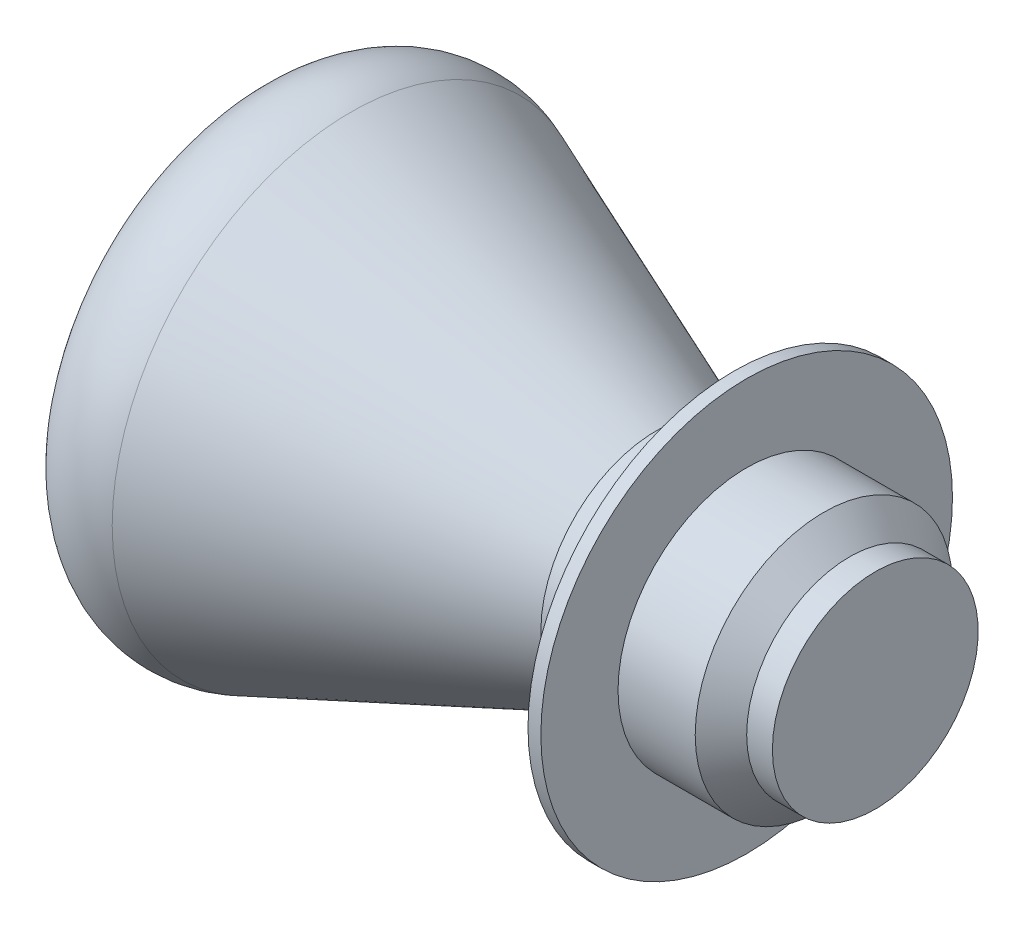
ISO-10303-21;
HEADER;
FILE_DESCRIPTION(('STEP AP214'),'2;1');
FILE_NAME('part.step','',(''),(''),'','','');
FILE_SCHEMA(('AUTOMOTIVE_DESIGN { 1 0 10303 214 1 1 1 1 }'));
ENDSEC;
DATA;
#1=APPLICATION_CONTEXT('core data for automotive mechanical design processes');
#2=APPLICATION_PROTOCOL_DEFINITION('international standard','automotive_design',2000,#1);
#3=PRODUCT_CONTEXT('',#1,'mechanical');
#4=PRODUCT('Part','Part','',(#3));
#5=PRODUCT_RELATED_PRODUCT_CATEGORY('part','',(#4));
#6=PRODUCT_DEFINITION_FORMATION('','',#4);
#7=PRODUCT_DEFINITION_CONTEXT('part definition',#1,'design');
#8=PRODUCT_DEFINITION('design','',#6,#7);
#9=PRODUCT_DEFINITION_SHAPE('','',#8);
#10=(LENGTH_UNIT() NAMED_UNIT(*) SI_UNIT(.MILLI.,.METRE.));
#11=(NAMED_UNIT(*) PLANE_ANGLE_UNIT() SI_UNIT($,.RADIAN.));
#12=(NAMED_UNIT(*) SI_UNIT($,.STERADIAN.) SOLID_ANGLE_UNIT());
#13=UNCERTAINTY_MEASURE_WITH_UNIT(LENGTH_MEASURE(1.E-05),#10,'distance_accuracy_value','');
#14=(GEOMETRIC_REPRESENTATION_CONTEXT(3) GLOBAL_UNCERTAINTY_ASSIGNED_CONTEXT((#13)) GLOBAL_UNIT_ASSIGNED_CONTEXT((#10,
#11,#12)) REPRESENTATION_CONTEXT('',''));
#15=CARTESIAN_POINT('',(0.,0.,0.));
#16=DIRECTION('',(0.,0.,1.));
#17=DIRECTION('',(1.,0.,0.));
#18=AXIS2_PLACEMENT_3D('',#15,#16,#17);
#19=CARTESIAN_POINT('',(5.5,0.,0.));
#20=DIRECTION('',(-1.,0.,0.));
#21=DIRECTION('',(0.,0.,1.));
#22=AXIS2_PLACEMENT_3D('',#19,#20,#21);
#23=PLANE('',#22);
#24=CARTESIAN_POINT('',(5.5,0.,0.));
#25=DIRECTION('',(-1.,0.,0.));
#26=DIRECTION('',(0.,0.,1.));
#27=AXIS2_PLACEMENT_3D('',#24,#25,#26);
#28=CIRCLE('',#27,4.);
#29=CARTESIAN_POINT('',(5.5,0.,4.));
#30=VERTEX_POINT('',#29);
#31=EDGE_CURVE('E10',#30,#30,#28,.T.);
#32=ORIENTED_EDGE('',*,*,#31,.F.);
#33=EDGE_LOOP('',(#32));
#34=FACE_BOUND('',#33,.T.);
#35=ADVANCED_FACE('F37',(#34),#23,.F.);
#36=CARTESIAN_POINT('',(-2.,0.,0.));
#37=DIRECTION('',(-1.,0.,0.));
#38=DIRECTION('',(0.,0.,1.));
#39=AXIS2_PLACEMENT_3D('',#36,#37,#38);
#40=CYLINDRICAL_SURFACE('',#39,4.);
#41=CARTESIAN_POINT('',(4.5,0.,0.));
#42=DIRECTION('',(-1.,0.,0.));
#43=DIRECTION('',(0.,0.,1.));
#44=AXIS2_PLACEMENT_3D('',#41,#42,#43);
#45=CIRCLE('',#44,4.);
#46=CARTESIAN_POINT('',(4.5,0.,4.));
#47=VERTEX_POINT('',#46);
#48=EDGE_CURVE('E45',#47,#47,#45,.T.);
#49=ORIENTED_EDGE('',*,*,#48,.F.);
#50=EDGE_LOOP('',(#49));
#51=FACE_BOUND('',#50,.T.);
#52=ORIENTED_EDGE('',*,*,#31,.T.);
#53=EDGE_LOOP('',(#52));
#54=FACE_BOUND('',#53,.T.);
#55=ADVANCED_FACE('F105',(#51,#54),#40,.T.);
#56=CARTESIAN_POINT('',(4.5,0.,0.));
#57=DIRECTION('',(-1.,0.,0.));
#58=DIRECTION('',(0.,0.,1.));
#59=AXIS2_PLACEMENT_3D('',#56,#57,#58);
#60=CONICAL_SURFACE('',#59,4.,0.785398163397447);
#61=CARTESIAN_POINT('',(3.5,0.,0.));
#62=DIRECTION('',(-1.,0.,0.));
#63=DIRECTION('',(0.,0.,1.));
#64=AXIS2_PLACEMENT_3D('',#61,#62,#63);
#65=CIRCLE('',#64,5.);
#66=CARTESIAN_POINT('',(3.5,0.,5.));
#67=VERTEX_POINT('',#66);
#68=EDGE_CURVE('E50',#67,#67,#65,.T.);
#69=ORIENTED_EDGE('',*,*,#68,.F.);
#70=EDGE_LOOP('',(#69));
#71=FACE_BOUND('',#70,.T.);
#72=ORIENTED_EDGE('',*,*,#48,.T.);
#73=EDGE_LOOP('',(#72));
#74=FACE_BOUND('',#73,.T.);
#75=ADVANCED_FACE('F110',(#71,#74),#60,.T.);
#76=CARTESIAN_POINT('',(-2.,0.,0.));
#77=DIRECTION('',(-1.,0.,0.));
#78=DIRECTION('',(0.,0.,1.));
#79=AXIS2_PLACEMENT_3D('',#76,#77,#78);
#80=CYLINDRICAL_SURFACE('',#79,5.);
#81=CARTESIAN_POINT('',(0.5,0.,0.));
#82=DIRECTION('',(-1.,0.,0.));
#83=DIRECTION('',(0.,0.,1.));
#84=AXIS2_PLACEMENT_3D('',#81,#82,#83);
#85=CIRCLE('',#84,5.);
#86=CARTESIAN_POINT('',(0.5,0.,5.));
#87=VERTEX_POINT('',#86);
#88=EDGE_CURVE('E56',#87,#87,#85,.T.);
#89=ORIENTED_EDGE('',*,*,#88,.F.);
#90=EDGE_LOOP('',(#89));
#91=FACE_BOUND('',#90,.T.);
#92=ORIENTED_EDGE('',*,*,#68,.T.);
#93=EDGE_LOOP('',(#92));
#94=FACE_BOUND('',#93,.T.);
#95=ADVANCED_FACE('F115',(#91,#94),#80,.T.);
#96=CARTESIAN_POINT('',(0.5,5.,0.));
#97=DIRECTION('',(-1.,0.,0.));
#98=DIRECTION('',(0.,0.,1.));
#99=AXIS2_PLACEMENT_3D('',#96,#97,#98);
#100=PLANE('',#99);
#101=CARTESIAN_POINT('',(0.5,0.,0.));
#102=DIRECTION('',(-1.,0.,0.));
#103=DIRECTION('',(0.,0.,1.));
#104=AXIS2_PLACEMENT_3D('',#101,#102,#103);
#105=CIRCLE('',#104,8.);
#106=CARTESIAN_POINT('',(0.5,0.,8.));
#107=VERTEX_POINT('',#106);
#108=EDGE_CURVE('E60',#107,#107,#105,.T.);
#109=ORIENTED_EDGE('',*,*,#108,.F.);
#110=EDGE_LOOP('',(#109));
#111=FACE_BOUND('',#110,.T.);
#112=ORIENTED_EDGE('',*,*,#88,.T.);
#113=EDGE_LOOP('',(#112));
#114=FACE_BOUND('',#113,.T.);
#115=ADVANCED_FACE('F122',(#111,#114),#100,.F.);
#116=CARTESIAN_POINT('',(-2.,0.,0.));
#117=DIRECTION('',(-1.,0.,0.));
#118=DIRECTION('',(0.,0.,1.));
#119=AXIS2_PLACEMENT_3D('',#116,#117,#118);
#120=CYLINDRICAL_SURFACE('',#119,8.);
#121=CARTESIAN_POINT('',(0.,0.,0.));
#122=DIRECTION('',(-1.,0.,0.));
#123=DIRECTION('',(0.,0.,1.));
#124=AXIS2_PLACEMENT_3D('',#121,#122,#123);
#125=CIRCLE('',#124,8.);
#126=CARTESIAN_POINT('',(0.,0.,8.));
#127=VERTEX_POINT('',#126);
#128=EDGE_CURVE('E64',#127,#127,#125,.T.);
#129=ORIENTED_EDGE('',*,*,#128,.F.);
#130=EDGE_LOOP('',(#129));
#131=FACE_BOUND('',#130,.T.);
#132=ORIENTED_EDGE('',*,*,#108,.T.);
#133=EDGE_LOOP('',(#132));
#134=FACE_BOUND('',#133,.T.);
#135=ADVANCED_FACE('F126',(#131,#134),#120,.T.);
#136=CARTESIAN_POINT('',(0.,8.,0.));
#137=DIRECTION('',(1.,0.,0.));
#138=DIRECTION('',(0.,0.,-1.));
#139=AXIS2_PLACEMENT_3D('',#136,#137,#138);
#140=PLANE('',#139);
#141=CARTESIAN_POINT('',(0.,0.,0.));
#142=DIRECTION('',(-1.,0.,0.));
#143=DIRECTION('',(0.,0.,1.));
#144=AXIS2_PLACEMENT_3D('',#141,#142,#143);
#145=CIRCLE('',#144,5.);
#146=CARTESIAN_POINT('',(0.,0.,5.));
#147=VERTEX_POINT('',#146);
#148=EDGE_CURVE('E68',#147,#147,#145,.T.);
#149=ORIENTED_EDGE('',*,*,#148,.F.);
#150=EDGE_LOOP('',(#149));
#151=FACE_BOUND('',#150,.T.);
#152=ORIENTED_EDGE('',*,*,#128,.T.);
#153=EDGE_LOOP('',(#152));
#154=FACE_BOUND('',#153,.T.);
#155=ADVANCED_FACE('F130',(#151,#154),#140,.F.);
#156=CARTESIAN_POINT('',(-2.,0.,0.));
#157=DIRECTION('',(-1.,0.,0.));
#158=DIRECTION('',(0.,0.,1.));
#159=AXIS2_PLACEMENT_3D('',#156,#157,#158);
#160=CYLINDRICAL_SURFACE('',#159,5.);
#161=CARTESIAN_POINT('',(-2.,0.,0.));
#162=DIRECTION('',(-1.,0.,0.));
#163=DIRECTION('',(0.,0.,1.));
#164=AXIS2_PLACEMENT_3D('',#161,#162,#163);
#165=CIRCLE('',#164,5.);
#166=CARTESIAN_POINT('',(-2.,0.,5.));
#167=VERTEX_POINT('',#166);
#168=EDGE_CURVE('E72',#167,#167,#165,.T.);
#169=ORIENTED_EDGE('',*,*,#168,.F.);
#170=EDGE_LOOP('',(#169));
#171=FACE_BOUND('',#170,.T.);
#172=ORIENTED_EDGE('',*,*,#148,.T.);
#173=EDGE_LOOP('',(#172));
#174=FACE_BOUND('',#173,.T.);
#175=ADVANCED_FACE('F134',(#171,#174),#160,.T.);
#176=CARTESIAN_POINT('',(-2.,5.,0.));
#177=DIRECTION('',(1.,0.,0.));
#178=DIRECTION('',(0.,0.,-1.));
#179=AXIS2_PLACEMENT_3D('',#176,#177,#178);
#180=PLANE('',#179);
#181=CARTESIAN_POINT('',(-2.,0.,0.));
#182=DIRECTION('',(1.,0.,0.));
#183=DIRECTION('',(0.,0.,-1.));
#184=AXIS2_PLACEMENT_3D('',#181,#182,#183);
#185=CIRCLE('',#184,4.5);
#186=CARTESIAN_POINT('',(-2.,0.,-4.5));
#187=VERTEX_POINT('',#186);
#188=EDGE_CURVE('E40',#187,#187,#185,.T.);
#189=ORIENTED_EDGE('',*,*,#188,.T.);
#190=EDGE_LOOP('',(#189));
#191=FACE_BOUND('',#190,.T.);
#192=ORIENTED_EDGE('',*,*,#168,.T.);
#193=EDGE_LOOP('',(#192));
#194=FACE_BOUND('',#193,.T.);
#195=ADVANCED_FACE('F138',(#191,#194),#180,.F.);
#196=CARTESIAN_POINT('',(0.,0.,0.));
#197=DIRECTION('',(1.,0.,0.));
#198=DIRECTION('',(0.,0.,-1.));
#199=AXIS2_PLACEMENT_3D('',#196,#197,#198);
#200=CYLINDRICAL_SURFACE('',#199,4.5);
#201=CARTESIAN_POINT('',(-3.,0.,0.));
#202=DIRECTION('',(1.,0.,0.));
#203=DIRECTION('',(0.,0.,-1.));
#204=AXIS2_PLACEMENT_3D('',#201,#202,#203);
#205=CIRCLE('',#204,4.5);
#206=CARTESIAN_POINT('',(-3.,0.,-4.5));
#207=VERTEX_POINT('',#206);
#208=EDGE_CURVE('E84',#207,#207,#205,.T.);
#209=ORIENTED_EDGE('',*,*,#208,.T.);
#210=EDGE_LOOP('',(#209));
#211=FACE_BOUND('',#210,.T.);
#212=ORIENTED_EDGE('',*,*,#188,.F.);
#213=EDGE_LOOP('',(#212));
#214=FACE_BOUND('',#213,.T.);
#215=ADVANCED_FACE('F89',(#211,#214),#200,.T.);
#216=CARTESIAN_POINT('',(8.18163766166386,0.,0.));
#217=DIRECTION('',(1.,0.,0.));
#218=DIRECTION('',(0.,1.,0.));
#219=AXIS2_PLACEMENT_3D('',#216,#217,#218);
#220=SPHERICAL_SURFACE('',#219,28.04);
#221=CARTESIAN_POINT('',(-18.8971610617009,0.,0.));
#222=DIRECTION('',(1.,0.,0.));
#223=DIRECTION('',(0.,0.,-1.));
#224=AXIS2_PLACEMENT_3D('',#221,#222,#223);
#225=CIRCLE('',#224,7.27875399361022);
#226=CARTESIAN_POINT('',(-18.8971610617009,0.,-7.27875399361022));
#227=VERTEX_POINT('',#226);
#228=EDGE_CURVE('E76',#227,#227,#225,.T.);
#229=ORIENTED_EDGE('',*,*,#228,.F.);
#230=EDGE_LOOP('',(#229));
#231=FACE_BOUND('',#230,.T.);
#232=ADVANCED_FACE('F100',(#231),#220,.T.);
#233=CARTESIAN_POINT('',(-16.,0.,0.));
#234=DIRECTION('',(1.,0.,0.));
#235=DIRECTION('',(0.,0.,-1.));
#236=AXIS2_PLACEMENT_3D('',#233,#234,#235);
#237=TOROIDAL_SURFACE('',#236,6.5,3.);
#238=ORIENTED_EDGE('',*,*,#228,.T.);
#239=EDGE_LOOP('',(#238));
#240=FACE_BOUND('',#239,.T.);
#241=CARTESIAN_POINT('',(-14.8795520760162,0.,0.));
#242=DIRECTION('',(1.,0.,0.));
#243=DIRECTION('',(0.,0.,-1.));
#244=AXIS2_PLACEMENT_3D('',#241,#242,#243);
#245=CIRCLE('',#244,9.28291150589458);
#246=CARTESIAN_POINT('',(-14.8795520760162,0.,-9.28291150589458));
#247=VERTEX_POINT('',#246);
#248=EDGE_CURVE('E80',#247,#247,#245,.T.);
#249=ORIENTED_EDGE('',*,*,#248,.F.);
#250=EDGE_LOOP('',(#249));
#251=FACE_BOUND('',#250,.T.);
#252=ADVANCED_FACE('F94',(#240,#251),#237,.T.);
#253=CARTESIAN_POINT('',(-3.,0.,0.));
#254=DIRECTION('',(-1.,0.,0.));
#255=DIRECTION('',(0.,0.,1.));
#256=AXIS2_PLACEMENT_3D('',#253,#254,#255);
#257=CONICAL_SURFACE('',#256,4.5,0.382760510475255);
#258=ORIENTED_EDGE('',*,*,#248,.T.);
#259=EDGE_LOOP('',(#258));
#260=FACE_BOUND('',#259,.T.);
#261=ORIENTED_EDGE('',*,*,#208,.F.);
#262=EDGE_LOOP('',(#261));
#263=FACE_BOUND('',#262,.T.);
#264=ADVANCED_FACE('F92',(#260,#263),#257,.T.);
#265=CLOSED_SHELL('',(#35,#55,#75,#95,#115,#135,#155,#175,#195,#215,#232,#252,#264));
#266=MANIFOLD_SOLID_BREP('B2',#265);
#267=ADVANCED_BREP_SHAPE_REPRESENTATION('',(#18,#266),#14);
#268=SHAPE_DEFINITION_REPRESENTATION(#9,#267);
ENDSEC;
END-ISO-10303-21;
